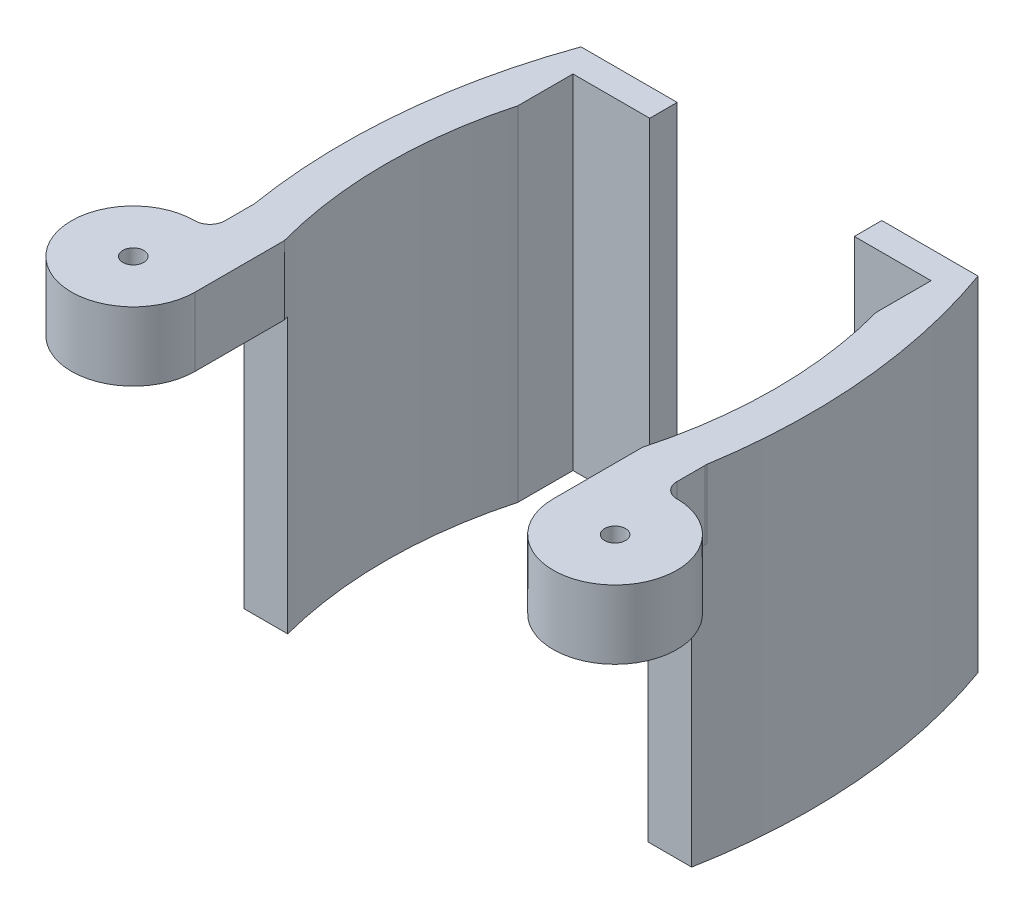
ISO-10303-21;
HEADER;
FILE_DESCRIPTION(('STEP AP214'),'2;1');
FILE_NAME('part.step','',(''),(''),'','','');
FILE_SCHEMA(('AUTOMOTIVE_DESIGN { 1 0 10303 214 1 1 1 1 }'));
ENDSEC;
DATA;
#1=APPLICATION_CONTEXT('core data for automotive mechanical design processes');
#2=APPLICATION_PROTOCOL_DEFINITION('international standard','automotive_design',2000,#1);
#3=PRODUCT_CONTEXT('',#1,'mechanical');
#4=PRODUCT('Part','Part','',(#3));
#5=PRODUCT_RELATED_PRODUCT_CATEGORY('part','',(#4));
#6=PRODUCT_DEFINITION_FORMATION('','',#4);
#7=PRODUCT_DEFINITION_CONTEXT('part definition',#1,'design');
#8=PRODUCT_DEFINITION('design','',#6,#7);
#9=PRODUCT_DEFINITION_SHAPE('','',#8);
#10=(LENGTH_UNIT() NAMED_UNIT(*) SI_UNIT(.MILLI.,.METRE.));
#11=(NAMED_UNIT(*) PLANE_ANGLE_UNIT() SI_UNIT($,.RADIAN.));
#12=(NAMED_UNIT(*) SI_UNIT($,.STERADIAN.) SOLID_ANGLE_UNIT());
#13=UNCERTAINTY_MEASURE_WITH_UNIT(LENGTH_MEASURE(1.E-05),#10,'distance_accuracy_value','');
#14=(GEOMETRIC_REPRESENTATION_CONTEXT(3) GLOBAL_UNCERTAINTY_ASSIGNED_CONTEXT((#13)) GLOBAL_UNIT_ASSIGNED_CONTEXT((#10,
#11,#12)) REPRESENTATION_CONTEXT('',''));
#15=CARTESIAN_POINT('',(0.,0.,0.));
#16=DIRECTION('',(0.,0.,1.));
#17=DIRECTION('',(1.,0.,0.));
#18=AXIS2_PLACEMENT_3D('',#15,#16,#17);
#19=CARTESIAN_POINT('',(17.3622752980796,0.,39.2467313511501));
#20=DIRECTION('',(0.,1.,0.));
#21=DIRECTION('',(0.,0.,1.));
#22=AXIS2_PLACEMENT_3D('',#19,#20,#21);
#23=PLANE('',#22);
#24=CARTESIAN_POINT('',(-70.9798633622335,0.,68.7645288120233));
#25=DIRECTION('',(0.,1.,0.));
#26=DIRECTION('',(0.,0.,1.));
#27=AXIS2_PLACEMENT_3D('',#24,#25,#26);
#28=CIRCLE('',#27,1.525);
#29=CARTESIAN_POINT('',(-70.9798633622335,0.,70.2895288120233));
#30=VERTEX_POINT('',#29);
#31=EDGE_CURVE('E239',#30,#30,#28,.T.);
#32=ORIENTED_EDGE('',*,*,#31,.F.);
#33=EDGE_LOOP('',(#32));
#34=FACE_BOUND('',#33,.T.);
#35=CARTESIAN_POINT('',(-70.9698282124346,0.,57.6104127686324));
#36=DIRECTION('',(0.,1.,0.));
#37=DIRECTION('',(0.,0.,1.));
#38=AXIS2_PLACEMENT_3D('',#35,#36,#37);
#39=CIRCLE('',#38,2.16920970238459);
#40=CARTESIAN_POINT('',(-70.9698282124346,0.,59.779622471017));
#41=VERTEX_POINT('',#40);
#42=CARTESIAN_POINT('',(-68.8006185100501,0.,57.6104127686324));
#43=VERTEX_POINT('',#42);
#44=EDGE_CURVE('E225',#41,#43,#39,.T.);
#45=ORIENTED_EDGE('',*,*,#44,.F.);
#46=CARTESIAN_POINT('',(-70.9949219793532,0.,68.7645288120234));
#47=DIRECTION('',(0.,1.,0.));
#48=DIRECTION('',(0.,0.,1.));
#49=AXIS2_PLACEMENT_3D('',#46,#47,#48);
#50=CIRCLE('',#49,8.9849413828803);
#51=CARTESIAN_POINT('',(-79.9798633622335,0.,68.7645288120233));
#52=VERTEX_POINT('',#51);
#53=EDGE_CURVE('E228',#41,#52,#50,.T.);
#54=ORIENTED_EDGE('',*,*,#53,.T.);
#55=CARTESIAN_POINT('',(-70.9798633622335,0.,68.7645288120233));
#56=DIRECTION('',(0.,1.,0.));
#57=DIRECTION('',(0.,0.,1.));
#58=AXIS2_PLACEMENT_3D('',#55,#56,#57);
#59=CIRCLE('',#58,9.00000000000001);
#60=CARTESIAN_POINT('',(-61.9798633622335,0.,68.7645288120233));
#61=VERTEX_POINT('',#60);
#62=EDGE_CURVE('E207',#52,#61,#59,.T.);
#63=ORIENTED_EDGE('',*,*,#62,.T.);
#64=DIRECTION('',(0.,0.,-1.));
#65=VECTOR('',#64,1.);
#66=CARTESIAN_POINT('',(-61.9798633622335,0.,63.7645288120233));
#67=LINE('',#66,#65);
#68=CARTESIAN_POINT('',(-61.9798633622335,0.,55.7645288120233));
#69=VERTEX_POINT('',#68);
#70=EDGE_CURVE('E143',#61,#69,#67,.T.);
#71=ORIENTED_EDGE('',*,*,#70,.T.);
#72=CARTESIAN_POINT('',(0.34316608916593,0.,38.7645288120234));
#73=DIRECTION('',(0.,-1.,0.));
#74=DIRECTION('',(0.,0.,-1.));
#75=AXIS2_PLACEMENT_3D('',#72,#73,#74);
#76=CIRCLE('',#75,64.6);
#77=CARTESIAN_POINT('',(-61.9798633622335,0.,21.7645288120234));
#78=VERTEX_POINT('',#77);
#79=EDGE_CURVE('E141',#69,#78,#76,.T.);
#80=ORIENTED_EDGE('',*,*,#79,.T.);
#81=DIRECTION('',(0.,0.,-1.));
#82=VECTOR('',#81,1.);
#83=CARTESIAN_POINT('',(-61.9798633622335,0.,21.7645288120234));
#84=LINE('',#83,#82);
#85=CARTESIAN_POINT('',(-61.9798633622335,0.,13.7645288120234));
#86=VERTEX_POINT('',#85);
#87=EDGE_CURVE('E124',#78,#86,#84,.T.);
#88=ORIENTED_EDGE('',*,*,#87,.T.);
#89=DIRECTION('',(1.,0.,0.));
#90=VECTOR('',#89,1.);
#91=CARTESIAN_POINT('',(-61.9798633622335,0.,13.7645288120234));
#92=LINE('',#91,#90);
#93=CARTESIAN_POINT('',(-50.8100577018505,0.,13.7645288120234));
#94=VERTEX_POINT('',#93);
#95=EDGE_CURVE('E132',#86,#94,#92,.T.);
#96=ORIENTED_EDGE('',*,*,#95,.T.);
#97=DIRECTION('',(0.,0.,-1.));
#98=VECTOR('',#97,1.);
#99=CARTESIAN_POINT('',(-50.8100577018505,0.,13.7645288120234));
#100=LINE('',#99,#98);
#101=CARTESIAN_POINT('',(-50.8100577018505,0.,9.76452881202337));
#102=VERTEX_POINT('',#101);
#103=EDGE_CURVE('E137',#94,#102,#100,.T.);
#104=ORIENTED_EDGE('',*,*,#103,.T.);
#105=DIRECTION('',(-1.,0.,0.));
#106=VECTOR('',#105,1.);
#107=CARTESIAN_POINT('',(-50.8100577018505,0.,9.76452881202337));
#108=LINE('',#107,#106);
#109=CARTESIAN_POINT('',(-64.8100577018505,0.,9.76452881202337));
#110=VERTEX_POINT('',#109);
#111=EDGE_CURVE('E161',#102,#110,#108,.T.);
#112=ORIENTED_EDGE('',*,*,#111,.T.);
#113=CARTESIAN_POINT('',(17.3622752980796,0.,39.2467313511501));
#114=DIRECTION('',(0.,1.,0.));
#115=DIRECTION('',(0.,0.,1.));
#116=AXIS2_PLACEMENT_3D('',#113,#114,#115);
#117=CIRCLE('',#116,87.3011602283125);
#118=CARTESIAN_POINT('',(-68.8006185100501,0.,53.298361428065));
#119=VERTEX_POINT('',#118);
#120=EDGE_CURVE('E65',#110,#119,#117,.T.);
#121=ORIENTED_EDGE('',*,*,#120,.T.);
#122=CARTESIAN_POINT('',(-70.0805033457437,0.,53.507087800374));
#123=DIRECTION('',(0.,-1.,0.));
#124=DIRECTION('',(0.,0.,1.));
#125=AXIS2_PLACEMENT_3D('',#122,#123,#124);
#126=CIRCLE('',#125,1.29679292531065);
#127=CARTESIAN_POINT('',(-68.8006185100501,0.,53.7158141726829));
#128=VERTEX_POINT('',#127);
#129=EDGE_CURVE('E197',#119,#128,#126,.T.);
#130=ORIENTED_EDGE('',*,*,#129,.T.);
#131=DIRECTION('',(0.,0.,1.));
#132=VECTOR('',#131,1.);
#133=CARTESIAN_POINT('',(-68.8006185100501,0.,0.));
#134=LINE('',#133,#132);
#135=EDGE_CURVE('E221',#128,#43,#134,.T.);
#136=ORIENTED_EDGE('',*,*,#135,.T.);
#137=EDGE_LOOP('',(#45,#54,#63,#71,#80,#88,#96,#104,#112,#121,#130,#136));
#138=FACE_BOUND('',#137,.T.);
#139=ADVANCED_FACE('F56',(#34,#138),#23,.T.);
#140=CARTESIAN_POINT('',(-70.9798633622335,-10.,63.7645288120233));
#141=DIRECTION('',(0.,-1.,0.));
#142=DIRECTION('',(0.,0.,-1.));
#143=AXIS2_PLACEMENT_3D('',#140,#141,#142);
#144=PLANE('',#143);
#145=CARTESIAN_POINT('',(-70.9798633622335,-10.,68.7645288120233));
#146=DIRECTION('',(0.,1.,0.));
#147=DIRECTION('',(0.,0.,1.));
#148=AXIS2_PLACEMENT_3D('',#145,#146,#147);
#149=CIRCLE('',#148,1.525);
#150=CARTESIAN_POINT('',(-70.9798633622335,-10.,70.2895288120233));
#151=VERTEX_POINT('',#150);
#152=EDGE_CURVE('E231',#151,#151,#149,.T.);
#153=ORIENTED_EDGE('',*,*,#152,.T.);
#154=EDGE_LOOP('',(#153));
#155=FACE_BOUND('',#154,.T.);
#156=CARTESIAN_POINT('',(-70.9798633622335,-10.,68.7645288120233));
#157=DIRECTION('',(0.,-1.,0.));
#158=DIRECTION('',(0.,0.,-1.));
#159=AXIS2_PLACEMENT_3D('',#156,#157,#158);
#160=CIRCLE('',#159,9.00000000000001);
#161=CARTESIAN_POINT('',(-79.9798633622335,-10.,68.7645288120233));
#162=VERTEX_POINT('',#161);
#163=CARTESIAN_POINT('',(-61.9798633622335,-10.,68.7645288120233));
#164=VERTEX_POINT('',#163);
#165=EDGE_CURVE('E206',#162,#164,#160,.F.);
#166=ORIENTED_EDGE('',*,*,#165,.F.);
#167=CARTESIAN_POINT('',(-70.9949219793532,-10.,68.7645288120234));
#168=DIRECTION('',(0.,1.,0.));
#169=DIRECTION('',(0.,0.,1.));
#170=AXIS2_PLACEMENT_3D('',#167,#168,#169);
#171=CIRCLE('',#170,8.9849413828803);
#172=CARTESIAN_POINT('',(-70.9698282124346,-10.,59.779622471017));
#173=VERTEX_POINT('',#172);
#174=EDGE_CURVE('E224',#173,#162,#171,.T.);
#175=ORIENTED_EDGE('',*,*,#174,.F.);
#176=CARTESIAN_POINT('',(-70.9698282124346,-10.,57.6104127686324));
#177=DIRECTION('',(0.,1.,0.));
#178=DIRECTION('',(0.,0.,1.));
#179=AXIS2_PLACEMENT_3D('',#176,#177,#178);
#180=CIRCLE('',#179,2.16920970238459);
#181=CARTESIAN_POINT('',(-68.8006185100501,-10.,57.6104127686324));
#182=VERTEX_POINT('',#181);
#183=EDGE_CURVE('E234',#173,#182,#180,.T.);
#184=ORIENTED_EDGE('',*,*,#183,.T.);
#185=DIRECTION('',(0.,0.,1.));
#186=VECTOR('',#185,1.);
#187=CARTESIAN_POINT('',(-68.8006185100501,-10.,0.));
#188=LINE('',#187,#186);
#189=CARTESIAN_POINT('',(-68.8006185100501,-10.,53.7158141726829));
#190=VERTEX_POINT('',#189);
#191=EDGE_CURVE('E218',#190,#182,#188,.T.);
#192=ORIENTED_EDGE('',*,*,#191,.F.);
#193=CARTESIAN_POINT('',(-70.0805033457437,-10.,53.507087800374));
#194=DIRECTION('',(0.,-1.,0.));
#195=DIRECTION('',(0.,0.,1.));
#196=AXIS2_PLACEMENT_3D('',#193,#194,#195);
#197=CIRCLE('',#196,1.29679292531065);
#198=CARTESIAN_POINT('',(-68.8006185100501,-10.,53.298361428065));
#199=VERTEX_POINT('',#198);
#200=EDGE_CURVE('E196',#199,#190,#197,.T.);
#201=ORIENTED_EDGE('',*,*,#200,.F.);
#202=CARTESIAN_POINT('',(17.3622752980796,-10.,39.2467313511501));
#203=DIRECTION('',(0.,1.,0.));
#204=DIRECTION('',(0.,0.,1.));
#205=AXIS2_PLACEMENT_3D('',#202,#203,#204);
#206=CIRCLE('',#205,87.3011602283125);
#207=CARTESIAN_POINT('',(-68.4841691205783,-10.,55.1174766986052));
#208=VERTEX_POINT('',#207);
#209=EDGE_CURVE('E188',#208,#199,#206,.F.);
#210=ORIENTED_EDGE('',*,*,#209,.F.);
#211=DIRECTION('',(1.,0.,0.));
#212=VECTOR('',#211,1.);
#213=CARTESIAN_POINT('',(-68.4841691205783,-10.,55.1174766986052));
#214=LINE('',#213,#212);
#215=CARTESIAN_POINT('',(-62.1527625415756,-10.,55.1174766986052));
#216=VERTEX_POINT('',#215);
#217=EDGE_CURVE('E184',#208,#216,#214,.T.);
#218=ORIENTED_EDGE('',*,*,#217,.T.);
#219=CARTESIAN_POINT('',(0.34316608916593,-10.,38.7645288120234));
#220=DIRECTION('',(0.,-1.,0.));
#221=DIRECTION('',(0.,0.,-1.));
#222=AXIS2_PLACEMENT_3D('',#219,#220,#221);
#223=CIRCLE('',#222,64.6);
#224=CARTESIAN_POINT('',(-61.9798633622335,-10.,55.7645288120233));
#225=VERTEX_POINT('',#224);
#226=EDGE_CURVE('E171',#225,#216,#223,.T.);
#227=ORIENTED_EDGE('',*,*,#226,.F.);
#228=DIRECTION('',(0.,0.,-1.));
#229=VECTOR('',#228,1.);
#230=CARTESIAN_POINT('',(-61.9798633622335,-10.,63.7645288120233));
#231=LINE('',#230,#229);
#232=EDGE_CURVE('E179',#164,#225,#231,.T.);
#233=ORIENTED_EDGE('',*,*,#232,.F.);
#234=EDGE_LOOP('',(#166,#175,#184,#192,#201,#210,#218,#227,#233));
#235=FACE_BOUND('',#234,.T.);
#236=ADVANCED_FACE('F245',(#155,#235),#144,.T.);
#237=CARTESIAN_POINT('',(-70.0805033457437,-10.,53.507087800374));
#238=DIRECTION('',(0.,1.,0.));
#239=DIRECTION('',(0.,0.,1.));
#240=AXIS2_PLACEMENT_3D('',#237,#238,#239);
#241=CYLINDRICAL_SURFACE('',#240,1.29679292531065);
#242=ORIENTED_EDGE('',*,*,#200,.T.);
#243=DIRECTION('',(0.,1.,0.));
#244=VECTOR('',#243,1.);
#245=CARTESIAN_POINT('',(-68.8006185100501,-10.,53.7158141726829));
#246=LINE('',#245,#244);
#247=EDGE_CURVE('E12',#190,#128,#246,.T.);
#248=ORIENTED_EDGE('',*,*,#247,.T.);
#249=ORIENTED_EDGE('',*,*,#129,.F.);
#250=DIRECTION('',(0.,1.,0.));
#251=VECTOR('',#250,1.);
#252=CARTESIAN_POINT('',(-68.8006185100501,-10.,53.298361428065));
#253=LINE('',#252,#251);
#254=EDGE_CURVE('E193',#199,#119,#253,.T.);
#255=ORIENTED_EDGE('',*,*,#254,.F.);
#256=EDGE_LOOP('',(#242,#248,#249,#255));
#257=FACE_BOUND('',#256,.T.);
#258=ADVANCED_FACE('F259',(#257),#241,.F.);
#259=CARTESIAN_POINT('',(-61.9798633622335,-50.,63.7645288120233));
#260=DIRECTION('',(1.,0.,0.));
#261=DIRECTION('',(0.,0.,-1.));
#262=AXIS2_PLACEMENT_3D('',#259,#260,#261);
#263=PLANE('',#262);
#264=ORIENTED_EDGE('',*,*,#70,.F.);
#265=DIRECTION('',(0.,1.,0.));
#266=VECTOR('',#265,1.);
#267=CARTESIAN_POINT('',(-61.9798633622335,-32.8035085019828,68.7645288120233));
#268=LINE('',#267,#266);
#269=EDGE_CURVE('E200',#164,#61,#268,.T.);
#270=ORIENTED_EDGE('',*,*,#269,.F.);
#271=ORIENTED_EDGE('',*,*,#232,.T.);
#272=DIRECTION('',(0.,1.,0.));
#273=VECTOR('',#272,1.);
#274=CARTESIAN_POINT('',(-61.9798633622335,-50.,55.7645288120233));
#275=LINE('',#274,#273);
#276=EDGE_CURVE('E73',#225,#69,#275,.T.);
#277=ORIENTED_EDGE('',*,*,#276,.T.);
#278=EDGE_LOOP('',(#264,#270,#271,#277));
#279=FACE_BOUND('',#278,.T.);
#280=ADVANCED_FACE('F277',(#279),#263,.T.);
#281=CARTESIAN_POINT('',(17.3622752980796,-50.,39.2467313511501));
#282=DIRECTION('',(0.,1.,0.));
#283=DIRECTION('',(0.,0.,1.));
#284=AXIS2_PLACEMENT_3D('',#281,#282,#283);
#285=CYLINDRICAL_SURFACE('',#284,87.3011602283125);
#286=ORIENTED_EDGE('',*,*,#254,.T.);
#287=ORIENTED_EDGE('',*,*,#120,.F.);
#288=DIRECTION('',(0.,1.,0.));
#289=VECTOR('',#288,1.);
#290=CARTESIAN_POINT('',(-64.8100577018505,-50.,9.76452881202337));
#291=LINE('',#290,#289);
#292=CARTESIAN_POINT('',(-64.8100577018505,-50.,9.76452881202337));
#293=VERTEX_POINT('',#292);
#294=EDGE_CURVE('E110',#293,#110,#291,.T.);
#295=ORIENTED_EDGE('',*,*,#294,.F.);
#296=CARTESIAN_POINT('',(17.3622752980796,-50.,39.2467313511501));
#297=DIRECTION('',(0.,1.,0.));
#298=DIRECTION('',(0.,0.,1.));
#299=AXIS2_PLACEMENT_3D('',#296,#297,#298);
#300=CIRCLE('',#299,87.3011602283125);
#301=CARTESIAN_POINT('',(-68.4841691205783,-50.,55.1174766986052));
#302=VERTEX_POINT('',#301);
#303=EDGE_CURVE('E159',#293,#302,#300,.T.);
#304=ORIENTED_EDGE('',*,*,#303,.T.);
#305=DIRECTION('',(0.,1.,0.));
#306=VECTOR('',#305,1.);
#307=CARTESIAN_POINT('',(-68.4841691205783,-50.,55.1174766986052));
#308=LINE('',#307,#306);
#309=EDGE_CURVE('E153',#302,#208,#308,.T.);
#310=ORIENTED_EDGE('',*,*,#309,.T.);
#311=ORIENTED_EDGE('',*,*,#209,.T.);
#312=EDGE_LOOP('',(#286,#287,#295,#304,#310,#311));
#313=FACE_BOUND('',#312,.T.);
#314=ADVANCED_FACE('F266',(#313),#285,.T.);
#315=CARTESIAN_POINT('',(-50.8100577018505,-50.,9.76452881202337));
#316=DIRECTION('',(0.,0.,-1.));
#317=DIRECTION('',(-1.,0.,0.));
#318=AXIS2_PLACEMENT_3D('',#315,#316,#317);
#319=PLANE('',#318);
#320=ORIENTED_EDGE('',*,*,#111,.F.);
#321=DIRECTION('',(0.,1.,0.));
#322=VECTOR('',#321,1.);
#323=CARTESIAN_POINT('',(-50.8100577018505,-50.,9.76452881202337));
#324=LINE('',#323,#322);
#325=CARTESIAN_POINT('',(-50.8100577018505,-50.,9.76452881202337));
#326=VERTEX_POINT('',#325);
#327=EDGE_CURVE('E170',#326,#102,#324,.T.);
#328=ORIENTED_EDGE('',*,*,#327,.F.);
#329=DIRECTION('',(-1.,0.,0.));
#330=VECTOR('',#329,1.);
#331=CARTESIAN_POINT('',(-50.8100577018505,-50.,9.76452881202337));
#332=LINE('',#331,#330);
#333=EDGE_CURVE('E150',#326,#293,#332,.T.);
#334=ORIENTED_EDGE('',*,*,#333,.T.);
#335=ORIENTED_EDGE('',*,*,#294,.T.);
#336=EDGE_LOOP('',(#320,#328,#334,#335));
#337=FACE_BOUND('',#336,.T.);
#338=ADVANCED_FACE('F262',(#337),#319,.T.);
#339=CARTESIAN_POINT('',(-50.8100577018505,-50.,13.7645288120234));
#340=DIRECTION('',(1.,0.,0.));
#341=DIRECTION('',(0.,0.,-1.));
#342=AXIS2_PLACEMENT_3D('',#339,#340,#341);
#343=PLANE('',#342);
#344=ORIENTED_EDGE('',*,*,#103,.F.);
#345=DIRECTION('',(0.,1.,0.));
#346=VECTOR('',#345,1.);
#347=CARTESIAN_POINT('',(-50.8100577018505,-50.,13.7645288120234));
#348=LINE('',#347,#346);
#349=CARTESIAN_POINT('',(-50.8100577018505,-50.,13.7645288120234));
#350=VERTEX_POINT('',#349);
#351=EDGE_CURVE('E129',#350,#94,#348,.T.);
#352=ORIENTED_EDGE('',*,*,#351,.F.);
#353=DIRECTION('',(0.,0.,-1.));
#354=VECTOR('',#353,1.);
#355=CARTESIAN_POINT('',(-50.8100577018505,-50.,13.7645288120234));
#356=LINE('',#355,#354);
#357=EDGE_CURVE('E152',#350,#326,#356,.T.);
#358=ORIENTED_EDGE('',*,*,#357,.T.);
#359=ORIENTED_EDGE('',*,*,#327,.T.);
#360=EDGE_LOOP('',(#344,#352,#358,#359));
#361=FACE_BOUND('',#360,.T.);
#362=ADVANCED_FACE('F265',(#361),#343,.T.);
#363=CARTESIAN_POINT('',(-61.9798633622335,-50.,13.7645288120234));
#364=DIRECTION('',(0.,0.,1.));
#365=DIRECTION('',(1.,0.,0.));
#366=AXIS2_PLACEMENT_3D('',#363,#364,#365);
#367=PLANE('',#366);
#368=ORIENTED_EDGE('',*,*,#95,.F.);
#369=DIRECTION('',(0.,1.,0.));
#370=VECTOR('',#369,1.);
#371=CARTESIAN_POINT('',(-61.9798633622335,-50.,13.7645288120234));
#372=LINE('',#371,#370);
#373=CARTESIAN_POINT('',(-61.9798633622335,-50.,13.7645288120234));
#374=VERTEX_POINT('',#373);
#375=EDGE_CURVE('E95',#374,#86,#372,.T.);
#376=ORIENTED_EDGE('',*,*,#375,.F.);
#377=DIRECTION('',(1.,0.,0.));
#378=VECTOR('',#377,1.);
#379=CARTESIAN_POINT('',(-61.9798633622335,-50.,13.7645288120234));
#380=LINE('',#379,#378);
#381=EDGE_CURVE('E156',#374,#350,#380,.T.);
#382=ORIENTED_EDGE('',*,*,#381,.T.);
#383=ORIENTED_EDGE('',*,*,#351,.T.);
#384=EDGE_LOOP('',(#368,#376,#382,#383));
#385=FACE_BOUND('',#384,.T.);
#386=ADVANCED_FACE('F133',(#385),#367,.T.);
#387=CARTESIAN_POINT('',(-61.9798633622335,-50.,21.7645288120234));
#388=DIRECTION('',(1.,0.,0.));
#389=DIRECTION('',(0.,0.,-1.));
#390=AXIS2_PLACEMENT_3D('',#387,#388,#389);
#391=PLANE('',#390);
#392=ORIENTED_EDGE('',*,*,#87,.F.);
#393=DIRECTION('',(0.,1.,0.));
#394=VECTOR('',#393,1.);
#395=CARTESIAN_POINT('',(-61.9798633622335,-50.,21.7645288120234));
#396=LINE('',#395,#394);
#397=CARTESIAN_POINT('',(-61.9798633622335,-50.,21.7645288120234));
#398=VERTEX_POINT('',#397);
#399=EDGE_CURVE('E128',#398,#78,#396,.T.);
#400=ORIENTED_EDGE('',*,*,#399,.F.);
#401=DIRECTION('',(0.,0.,-1.));
#402=VECTOR('',#401,1.);
#403=CARTESIAN_POINT('',(-61.9798633622335,-50.,21.7645288120234));
#404=LINE('',#403,#402);
#405=EDGE_CURVE('E127',#398,#374,#404,.T.);
#406=ORIENTED_EDGE('',*,*,#405,.T.);
#407=ORIENTED_EDGE('',*,*,#375,.T.);
#408=EDGE_LOOP('',(#392,#400,#406,#407));
#409=FACE_BOUND('',#408,.T.);
#410=ADVANCED_FACE('F122',(#409),#391,.T.);
#411=CARTESIAN_POINT('',(0.34316608916593,-50.,38.7645288120234));
#412=DIRECTION('',(0.,1.,0.));
#413=DIRECTION('',(0.,0.,1.));
#414=AXIS2_PLACEMENT_3D('',#411,#412,#413);
#415=CYLINDRICAL_SURFACE('',#414,64.6);
#416=DIRECTION('',(0.,1.,0.));
#417=VECTOR('',#416,1.);
#418=CARTESIAN_POINT('',(-62.1527625415756,-50.,55.1174766986052));
#419=LINE('',#418,#417);
#420=CARTESIAN_POINT('',(-62.1527625415756,-50.,55.1174766986052));
#421=VERTEX_POINT('',#420);
#422=EDGE_CURVE('E181',#421,#216,#419,.T.);
#423=ORIENTED_EDGE('',*,*,#422,.F.);
#424=CARTESIAN_POINT('',(0.34316608916593,-50.,38.7645288120234));
#425=DIRECTION('',(0.,-1.,0.));
#426=DIRECTION('',(0.,0.,-1.));
#427=AXIS2_PLACEMENT_3D('',#424,#425,#426);
#428=CIRCLE('',#427,64.6);
#429=EDGE_CURVE('E102',#421,#398,#428,.T.);
#430=ORIENTED_EDGE('',*,*,#429,.T.);
#431=ORIENTED_EDGE('',*,*,#399,.T.);
#432=ORIENTED_EDGE('',*,*,#79,.F.);
#433=ORIENTED_EDGE('',*,*,#276,.F.);
#434=ORIENTED_EDGE('',*,*,#226,.T.);
#435=EDGE_LOOP('',(#423,#430,#431,#432,#433,#434));
#436=FACE_BOUND('',#435,.T.);
#437=ADVANCED_FACE('F274',(#436),#415,.F.);
#438=CARTESIAN_POINT('',(17.3622752980796,-50.,39.2467313511501));
#439=DIRECTION('',(0.,1.,0.));
#440=DIRECTION('',(0.,0.,1.));
#441=AXIS2_PLACEMENT_3D('',#438,#439,#440);
#442=PLANE('',#441);
#443=ORIENTED_EDGE('',*,*,#429,.F.);
#444=DIRECTION('',(1.,0.,0.));
#445=VECTOR('',#444,1.);
#446=CARTESIAN_POINT('',(-62.1527625415756,-50.,55.1174766986052));
#447=LINE('',#446,#445);
#448=EDGE_CURVE('E185',#302,#421,#447,.T.);
#449=ORIENTED_EDGE('',*,*,#448,.F.);
#450=ORIENTED_EDGE('',*,*,#303,.F.);
#451=ORIENTED_EDGE('',*,*,#333,.F.);
#452=ORIENTED_EDGE('',*,*,#357,.F.);
#453=ORIENTED_EDGE('',*,*,#381,.F.);
#454=ORIENTED_EDGE('',*,*,#405,.F.);
#455=EDGE_LOOP('',(#443,#449,#450,#451,#452,#453,#454));
#456=FACE_BOUND('',#455,.T.);
#457=ADVANCED_FACE('F58',(#456),#442,.F.);
#458=CARTESIAN_POINT('',(-62.1527625415756,-10.,55.1174766986052));
#459=DIRECTION('',(0.,0.,-1.));
#460=DIRECTION('',(-1.,0.,0.));
#461=AXIS2_PLACEMENT_3D('',#458,#459,#460);
#462=PLANE('',#461);
#463=ORIENTED_EDGE('',*,*,#422,.T.);
#464=ORIENTED_EDGE('',*,*,#217,.F.);
#465=ORIENTED_EDGE('',*,*,#309,.F.);
#466=ORIENTED_EDGE('',*,*,#448,.T.);
#467=EDGE_LOOP('',(#463,#464,#465,#466));
#468=FACE_BOUND('',#467,.T.);
#469=ADVANCED_FACE('F282',(#468),#462,.F.);
#470=CARTESIAN_POINT('',(-70.9798633622335,-32.8035085019828,68.7645288120233));
#471=DIRECTION('',(0.,1.,0.));
#472=DIRECTION('',(0.,0.,1.));
#473=AXIS2_PLACEMENT_3D('',#470,#471,#472);
#474=CYLINDRICAL_SURFACE('',#473,9.00000000000001);
#475=DIRECTION('',(0.,1.,0.));
#476=VECTOR('',#475,1.);
#477=CARTESIAN_POINT('',(-79.9798633622335,-32.8035085019828,68.7645288120233));
#478=LINE('',#477,#476);
#479=EDGE_CURVE('E203',#162,#52,#478,.T.);
#480=ORIENTED_EDGE('',*,*,#479,.F.);
#481=ORIENTED_EDGE('',*,*,#165,.T.);
#482=ORIENTED_EDGE('',*,*,#269,.T.);
#483=ORIENTED_EDGE('',*,*,#62,.F.);
#484=EDGE_LOOP('',(#480,#481,#482,#483));
#485=FACE_BOUND('',#484,.T.);
#486=ADVANCED_FACE('F285',(#485),#474,.T.);
#487=CARTESIAN_POINT('',(-70.9949219793532,-10.,68.7645288120234));
#488=DIRECTION('',(0.,1.,0.));
#489=DIRECTION('',(0.,0.,1.));
#490=AXIS2_PLACEMENT_3D('',#487,#488,#489);
#491=CYLINDRICAL_SURFACE('',#490,8.9849413828803);
#492=ORIENTED_EDGE('',*,*,#53,.F.);
#493=DIRECTION('',(0.,1.,0.));
#494=VECTOR('',#493,1.);
#495=CARTESIAN_POINT('',(-70.9698282124346,-10.,59.779622471017));
#496=LINE('',#495,#494);
#497=EDGE_CURVE('E215',#173,#41,#496,.T.);
#498=ORIENTED_EDGE('',*,*,#497,.F.);
#499=ORIENTED_EDGE('',*,*,#174,.T.);
#500=ORIENTED_EDGE('',*,*,#479,.T.);
#501=EDGE_LOOP('',(#492,#498,#499,#500));
#502=FACE_BOUND('',#501,.T.);
#503=ADVANCED_FACE('F292',(#502),#491,.T.);
#504=CARTESIAN_POINT('',(-68.8006185100501,-10.,0.));
#505=DIRECTION('',(-1.,0.,0.));
#506=DIRECTION('',(0.,0.,1.));
#507=AXIS2_PLACEMENT_3D('',#504,#505,#506);
#508=PLANE('',#507);
#509=ORIENTED_EDGE('',*,*,#191,.T.);
#510=DIRECTION('',(0.,1.,0.));
#511=VECTOR('',#510,1.);
#512=CARTESIAN_POINT('',(-68.8006185100501,-10.,57.6104127686324));
#513=LINE('',#512,#511);
#514=EDGE_CURVE('E214',#182,#43,#513,.T.);
#515=ORIENTED_EDGE('',*,*,#514,.T.);
#516=ORIENTED_EDGE('',*,*,#135,.F.);
#517=ORIENTED_EDGE('',*,*,#247,.F.);
#518=EDGE_LOOP('',(#509,#515,#516,#517));
#519=FACE_BOUND('',#518,.T.);
#520=ADVANCED_FACE('F296',(#519),#508,.T.);
#521=CARTESIAN_POINT('',(-70.9698282124346,-10.,57.6104127686324));
#522=DIRECTION('',(0.,1.,0.));
#523=DIRECTION('',(0.,0.,1.));
#524=AXIS2_PLACEMENT_3D('',#521,#522,#523);
#525=CYLINDRICAL_SURFACE('',#524,2.16920970238459);
#526=ORIENTED_EDGE('',*,*,#44,.T.);
#527=ORIENTED_EDGE('',*,*,#514,.F.);
#528=ORIENTED_EDGE('',*,*,#183,.F.);
#529=ORIENTED_EDGE('',*,*,#497,.T.);
#530=EDGE_LOOP('',(#526,#527,#528,#529));
#531=FACE_BOUND('',#530,.T.);
#532=ADVANCED_FACE('F251',(#531),#525,.F.);
#533=CARTESIAN_POINT('',(-70.9798633622335,-10.,68.7645288120233));
#534=DIRECTION('',(0.,1.,0.));
#535=DIRECTION('',(0.,0.,1.));
#536=AXIS2_PLACEMENT_3D('',#533,#534,#535);
#537=CYLINDRICAL_SURFACE('',#536,1.525);
#538=ORIENTED_EDGE('',*,*,#152,.F.);
#539=EDGE_LOOP('',(#538));
#540=FACE_BOUND('',#539,.T.);
#541=ORIENTED_EDGE('',*,*,#31,.T.);
#542=EDGE_LOOP('',(#541));
#543=FACE_BOUND('',#542,.T.);
#544=ADVANCED_FACE('F248',(#540,#543),#537,.F.);
#545=CLOSED_SHELL('',(#139,#236,#258,#280,#314,#338,#362,#386,#410,#437,#457,#469,#486,#503,
#520,#532,#544));
#546=MANIFOLD_SOLID_BREP('B2',#545);
#547=CARTESIAN_POINT('',(-9.85551112134364,-50.,63.7645288120234));
#548=DIRECTION('',(-1.,0.,0.));
#549=DIRECTION('',(0.,0.,1.));
#550=AXIS2_PLACEMENT_3D('',#547,#548,#549);
#551=PLANE('',#550);
#552=DIRECTION('',(0.,1.,0.));
#553=VECTOR('',#552,1.);
#554=CARTESIAN_POINT('',(-9.85551112134364,-50.,55.7645288120234));
#555=LINE('',#554,#553);
#556=CARTESIAN_POINT('',(-9.85551112134364,-10.,55.7645288120234));
#557=VERTEX_POINT('',#556);
#558=CARTESIAN_POINT('',(-9.85551112134364,0.,55.7645288120234));
#559=VERTEX_POINT('',#558);
#560=EDGE_CURVE('E537',#557,#559,#555,.T.);
#561=ORIENTED_EDGE('',*,*,#560,.F.);
#562=DIRECTION('',(0.,0.,1.));
#563=VECTOR('',#562,1.);
#564=CARTESIAN_POINT('',(-9.85551112134364,-10.,63.7645288120234));
#565=LINE('',#564,#563);
#566=CARTESIAN_POINT('',(-9.85551112134364,-10.,68.7645288120233));
#567=VERTEX_POINT('',#566);
#568=EDGE_CURVE('E698',#557,#567,#565,.T.);
#569=ORIENTED_EDGE('',*,*,#568,.T.);
#570=DIRECTION('',(0.,1.,0.));
#571=VECTOR('',#570,1.);
#572=CARTESIAN_POINT('',(-9.85551112134364,-32.8035085019828,68.7645288120233));
#573=LINE('',#572,#571);
#574=CARTESIAN_POINT('',(-9.85551112134364,0.,68.7645288120233));
#575=VERTEX_POINT('',#574);
#576=EDGE_CURVE('E732',#567,#575,#573,.T.);
#577=ORIENTED_EDGE('',*,*,#576,.T.);
#578=DIRECTION('',(0.,0.,1.));
#579=VECTOR('',#578,1.);
#580=CARTESIAN_POINT('',(-9.85551112134364,0.,63.7645288120234));
#581=LINE('',#580,#579);
#582=EDGE_CURVE('E655',#559,#575,#581,.T.);
#583=ORIENTED_EDGE('',*,*,#582,.F.);
#584=EDGE_LOOP('',(#561,#569,#577,#583));
#585=FACE_BOUND('',#584,.T.);
#586=ADVANCED_FACE('F528',(#585),#551,.T.);
#587=CARTESIAN_POINT('',(-72.1785405727431,-50.,38.7645288120234));
#588=DIRECTION('',(0.,1.,0.));
#589=DIRECTION('',(0.,0.,1.));
#590=AXIS2_PLACEMENT_3D('',#587,#588,#589);
#591=CYLINDRICAL_SURFACE('',#590,64.6);
#592=DIRECTION('',(0.,1.,0.));
#593=VECTOR('',#592,1.);
#594=CARTESIAN_POINT('',(-9.68261194200155,-50.,55.1174766986052));
#595=LINE('',#594,#593);
#596=CARTESIAN_POINT('',(-9.68261194200154,-10.,55.1174766986052));
#597=VERTEX_POINT('',#596);
#598=CARTESIAN_POINT('',(-9.68261194200155,-50.,55.1174766986052));
#599=VERTEX_POINT('',#598);
#600=EDGE_CURVE('E702',#597,#599,#595,.F.);
#601=ORIENTED_EDGE('',*,*,#600,.F.);
#602=CARTESIAN_POINT('',(-72.1785405727431,-10.,38.7645288120234));
#603=DIRECTION('',(0.,-1.,0.));
#604=DIRECTION('',(0.,0.,-1.));
#605=AXIS2_PLACEMENT_3D('',#602,#603,#604);
#606=CIRCLE('',#605,64.6);
#607=EDGE_CURVE('E639',#597,#557,#606,.T.);
#608=ORIENTED_EDGE('',*,*,#607,.T.);
#609=ORIENTED_EDGE('',*,*,#560,.T.);
#610=CARTESIAN_POINT('',(-72.1785405727431,0.,38.7645288120234));
#611=DIRECTION('',(0.,-1.,0.));
#612=DIRECTION('',(0.,0.,1.));
#613=AXIS2_PLACEMENT_3D('',#610,#611,#612);
#614=CIRCLE('',#613,64.6);
#615=CARTESIAN_POINT('',(-9.85551112134365,0.,21.7645288120234));
#616=VERTEX_POINT('',#615);
#617=EDGE_CURVE('E652',#616,#559,#614,.T.);
#618=ORIENTED_EDGE('',*,*,#617,.F.);
#619=DIRECTION('',(0.,1.,0.));
#620=VECTOR('',#619,1.);
#621=CARTESIAN_POINT('',(-9.85551112134365,-50.,21.7645288120234));
#622=LINE('',#621,#620);
#623=CARTESIAN_POINT('',(-9.85551112134365,-50.,21.7645288120234));
#624=VERTEX_POINT('',#623);
#625=EDGE_CURVE('E553',#624,#616,#622,.T.);
#626=ORIENTED_EDGE('',*,*,#625,.F.);
#627=CARTESIAN_POINT('',(-72.1785405727431,-50.,38.7645288120234));
#628=DIRECTION('',(0.,-1.,0.));
#629=DIRECTION('',(0.,0.,1.));
#630=AXIS2_PLACEMENT_3D('',#627,#628,#629);
#631=CIRCLE('',#630,64.6);
#632=EDGE_CURVE('E631',#624,#599,#631,.T.);
#633=ORIENTED_EDGE('',*,*,#632,.T.);
#634=EDGE_LOOP('',(#601,#608,#609,#618,#626,#633));
#635=FACE_BOUND('',#634,.T.);
#636=ADVANCED_FACE('F812',(#635),#591,.F.);
#637=CARTESIAN_POINT('',(-9.85551112134364,-50.,21.7645288120234));
#638=DIRECTION('',(-1.,0.,0.));
#639=DIRECTION('',(0.,0.,1.));
#640=AXIS2_PLACEMENT_3D('',#637,#638,#639);
#641=PLANE('',#640);
#642=DIRECTION('',(0.,0.,1.));
#643=VECTOR('',#642,1.);
#644=CARTESIAN_POINT('',(-9.85551112134364,0.,21.7645288120234));
#645=LINE('',#644,#643);
#646=CARTESIAN_POINT('',(-9.85551112134364,0.,13.7645288120234));
#647=VERTEX_POINT('',#646);
#648=EDGE_CURVE('E648',#647,#616,#645,.T.);
#649=ORIENTED_EDGE('',*,*,#648,.F.);
#650=DIRECTION('',(0.,1.,0.));
#651=VECTOR('',#650,1.);
#652=CARTESIAN_POINT('',(-9.85551112134364,-50.,13.7645288120234));
#653=LINE('',#652,#651);
#654=CARTESIAN_POINT('',(-9.85551112134364,-50.,13.7645288120234));
#655=VERTEX_POINT('',#654);
#656=EDGE_CURVE('E607',#655,#647,#653,.T.);
#657=ORIENTED_EDGE('',*,*,#656,.F.);
#658=DIRECTION('',(0.,0.,1.));
#659=VECTOR('',#658,1.);
#660=CARTESIAN_POINT('',(-9.85551112134364,-50.,21.7645288120234));
#661=LINE('',#660,#659);
#662=EDGE_CURVE('E617',#655,#624,#661,.T.);
#663=ORIENTED_EDGE('',*,*,#662,.T.);
#664=ORIENTED_EDGE('',*,*,#625,.T.);
#665=EDGE_LOOP('',(#649,#657,#663,#664));
#666=FACE_BOUND('',#665,.T.);
#667=ADVANCED_FACE('F818',(#666),#641,.T.);
#668=CARTESIAN_POINT('',(-9.85551112134364,-50.,13.7645288120234));
#669=DIRECTION('',(0.,0.,1.));
#670=DIRECTION('',(1.,0.,0.));
#671=AXIS2_PLACEMENT_3D('',#668,#669,#670);
#672=PLANE('',#671);
#673=DIRECTION('',(1.,0.,0.));
#674=VECTOR('',#673,1.);
#675=CARTESIAN_POINT('',(-9.85551112134364,0.,13.7645288120234));
#676=LINE('',#675,#674);
#677=CARTESIAN_POINT('',(-21.0253167817267,0.,13.7645288120234));
#678=VERTEX_POINT('',#677);
#679=EDGE_CURVE('E601',#678,#647,#676,.T.);
#680=ORIENTED_EDGE('',*,*,#679,.F.);
#681=DIRECTION('',(0.,1.,0.));
#682=VECTOR('',#681,1.);
#683=CARTESIAN_POINT('',(-21.0253167817267,-50.,13.7645288120234));
#684=LINE('',#683,#682);
#685=CARTESIAN_POINT('',(-21.0253167817267,-50.,13.7645288120234));
#686=VERTEX_POINT('',#685);
#687=EDGE_CURVE('E596',#686,#678,#684,.T.);
#688=ORIENTED_EDGE('',*,*,#687,.F.);
#689=DIRECTION('',(1.,0.,0.));
#690=VECTOR('',#689,1.);
#691=CARTESIAN_POINT('',(-9.85551112134364,-50.,13.7645288120234));
#692=LINE('',#691,#690);
#693=EDGE_CURVE('E599',#686,#655,#692,.T.);
#694=ORIENTED_EDGE('',*,*,#693,.T.);
#695=ORIENTED_EDGE('',*,*,#656,.T.);
#696=EDGE_LOOP('',(#680,#688,#694,#695));
#697=FACE_BOUND('',#696,.T.);
#698=ADVANCED_FACE('F598',(#697),#672,.T.);
#699=CARTESIAN_POINT('',(-21.0253167817267,-50.,13.7645288120234));
#700=DIRECTION('',(-1.,0.,0.));
#701=DIRECTION('',(0.,0.,1.));
#702=AXIS2_PLACEMENT_3D('',#699,#700,#701);
#703=PLANE('',#702);
#704=DIRECTION('',(0.,0.,1.));
#705=VECTOR('',#704,1.);
#706=CARTESIAN_POINT('',(-21.0253167817267,0.,13.7645288120234));
#707=LINE('',#706,#705);
#708=CARTESIAN_POINT('',(-21.0253167817267,0.,9.76452881202336));
#709=VERTEX_POINT('',#708);
#710=EDGE_CURVE('E643',#709,#678,#707,.T.);
#711=ORIENTED_EDGE('',*,*,#710,.F.);
#712=DIRECTION('',(0.,1.,0.));
#713=VECTOR('',#712,1.);
#714=CARTESIAN_POINT('',(-21.0253167817267,-50.,9.76452881202336));
#715=LINE('',#714,#713);
#716=CARTESIAN_POINT('',(-21.0253167817267,-50.,9.76452881202336));
#717=VERTEX_POINT('',#716);
#718=EDGE_CURVE('E608',#717,#709,#715,.T.);
#719=ORIENTED_EDGE('',*,*,#718,.F.);
#720=DIRECTION('',(0.,0.,1.));
#721=VECTOR('',#720,1.);
#722=CARTESIAN_POINT('',(-21.0253167817267,-50.,13.7645288120234));
#723=LINE('',#722,#721);
#724=EDGE_CURVE('E615',#717,#686,#723,.T.);
#725=ORIENTED_EDGE('',*,*,#724,.T.);
#726=ORIENTED_EDGE('',*,*,#687,.T.);
#727=EDGE_LOOP('',(#711,#719,#725,#726));
#728=FACE_BOUND('',#727,.T.);
#729=ADVANCED_FACE('F620',(#728),#703,.T.);
#730=CARTESIAN_POINT('',(-21.0253167817267,-50.,9.76452881202336));
#731=DIRECTION('',(0.,0.,-1.));
#732=DIRECTION('',(-1.,0.,0.));
#733=AXIS2_PLACEMENT_3D('',#730,#731,#732);
#734=PLANE('',#733);
#735=DIRECTION('',(-1.,0.,0.));
#736=VECTOR('',#735,1.);
#737=CARTESIAN_POINT('',(-21.0253167817267,0.,9.76452881202336));
#738=LINE('',#737,#736);
#739=CARTESIAN_POINT('',(-7.02531678172666,0.,9.76452881202336));
#740=VERTEX_POINT('',#739);
#741=EDGE_CURVE('E638',#740,#709,#738,.T.);
#742=ORIENTED_EDGE('',*,*,#741,.F.);
#743=DIRECTION('',(0.,1.,0.));
#744=VECTOR('',#743,1.);
#745=CARTESIAN_POINT('',(-7.02531678172666,-50.,9.76452881202336));
#746=LINE('',#745,#744);
#747=CARTESIAN_POINT('',(-7.02531678172666,-50.,9.76452881202336));
#748=VERTEX_POINT('',#747);
#749=EDGE_CURVE('E586',#748,#740,#746,.T.);
#750=ORIENTED_EDGE('',*,*,#749,.F.);
#751=DIRECTION('',(-1.,0.,0.));
#752=VECTOR('',#751,1.);
#753=CARTESIAN_POINT('',(-21.0253167817267,-50.,9.76452881202336));
#754=LINE('',#753,#752);
#755=EDGE_CURVE('E622',#748,#717,#754,.T.);
#756=ORIENTED_EDGE('',*,*,#755,.T.);
#757=ORIENTED_EDGE('',*,*,#718,.T.);
#758=EDGE_LOOP('',(#742,#750,#756,#757));
#759=FACE_BOUND('',#758,.T.);
#760=ADVANCED_FACE('F804',(#759),#734,.T.);
#761=CARTESIAN_POINT('',(-89.1976497816567,-50.,39.2467313511501));
#762=DIRECTION('',(0.,1.,0.));
#763=DIRECTION('',(0.,0.,1.));
#764=AXIS2_PLACEMENT_3D('',#761,#762,#763);
#765=CYLINDRICAL_SURFACE('',#764,87.3011602283125);
#766=DIRECTION('',(0.,1.,0.));
#767=VECTOR('',#766,1.);
#768=CARTESIAN_POINT('',(-3.02456392552264,-50.,53.2357217093151));
#769=LINE('',#768,#767);
#770=CARTESIAN_POINT('',(-3.02456392552264,-10.,53.2357217093151));
#771=VERTEX_POINT('',#770);
#772=CARTESIAN_POINT('',(-3.02456392552264,0.,53.2357217093151));
#773=VERTEX_POINT('',#772);
#774=EDGE_CURVE('E707',#771,#773,#769,.T.);
#775=ORIENTED_EDGE('',*,*,#774,.F.);
#776=CARTESIAN_POINT('',(-89.1976497816567,-10.,39.2467313511501));
#777=DIRECTION('',(0.,1.,0.));
#778=DIRECTION('',(0.,0.,1.));
#779=AXIS2_PLACEMENT_3D('',#776,#777,#778);
#780=CIRCLE('',#779,87.3011602283125);
#781=CARTESIAN_POINT('',(-3.35120536299882,-10.,55.1174766986052));
#782=VERTEX_POINT('',#781);
#783=EDGE_CURVE('E691',#771,#782,#780,.F.);
#784=ORIENTED_EDGE('',*,*,#783,.T.);
#785=DIRECTION('',(0.,1.,0.));
#786=VECTOR('',#785,1.);
#787=CARTESIAN_POINT('',(-3.35120536299882,-50.,55.1174766986052));
#788=LINE('',#787,#786);
#789=CARTESIAN_POINT('',(-3.35120536299882,-50.,55.1174766986052));
#790=VERTEX_POINT('',#789);
#791=EDGE_CURVE('E634',#790,#782,#788,.T.);
#792=ORIENTED_EDGE('',*,*,#791,.F.);
#793=CARTESIAN_POINT('',(-89.1976497816567,-50.,39.2467313511501));
#794=DIRECTION('',(0.,1.,0.));
#795=DIRECTION('',(0.,0.,-1.));
#796=AXIS2_PLACEMENT_3D('',#793,#794,#795);
#797=CIRCLE('',#796,87.3011602283125);
#798=EDGE_CURVE('E625',#790,#748,#797,.T.);
#799=ORIENTED_EDGE('',*,*,#798,.T.);
#800=ORIENTED_EDGE('',*,*,#749,.T.);
#801=CARTESIAN_POINT('',(-89.1976497816567,0.,39.2467313511501));
#802=DIRECTION('',(0.,1.,0.));
#803=DIRECTION('',(0.,0.,-1.));
#804=AXIS2_PLACEMENT_3D('',#801,#802,#803);
#805=CIRCLE('',#804,87.3011602283125);
#806=EDGE_CURVE('E635',#773,#740,#805,.T.);
#807=ORIENTED_EDGE('',*,*,#806,.F.);
#808=EDGE_LOOP('',(#775,#784,#792,#799,#800,#807));
#809=FACE_BOUND('',#808,.T.);
#810=ADVANCED_FACE('F530',(#809),#765,.T.);
#811=CARTESIAN_POINT('',(-0.855511121343641,-50.,63.7645288120234));
#812=DIRECTION('',(0.,1.,0.));
#813=DIRECTION('',(0.,0.,1.));
#814=AXIS2_PLACEMENT_3D('',#811,#812,#813);
#815=PLANE('',#814);
#816=ORIENTED_EDGE('',*,*,#798,.F.);
#817=DIRECTION('',(1.,0.,0.));
#818=VECTOR('',#817,1.);
#819=CARTESIAN_POINT('',(-62.1527625415756,-50.,55.1174766986052));
#820=LINE('',#819,#818);
#821=EDGE_CURVE('E683',#599,#790,#820,.T.);
#822=ORIENTED_EDGE('',*,*,#821,.F.);
#823=ORIENTED_EDGE('',*,*,#632,.F.);
#824=ORIENTED_EDGE('',*,*,#662,.F.);
#825=ORIENTED_EDGE('',*,*,#693,.F.);
#826=ORIENTED_EDGE('',*,*,#724,.F.);
#827=ORIENTED_EDGE('',*,*,#755,.F.);
#828=EDGE_LOOP('',(#816,#822,#823,#824,#825,#826,#827));
#829=FACE_BOUND('',#828,.T.);
#830=ADVANCED_FACE('F614',(#829),#815,.F.);
#831=CARTESIAN_POINT('',(-0.855511121343641,0.,63.7645288120234));
#832=DIRECTION('',(0.,1.,0.));
#833=DIRECTION('',(0.,0.,1.));
#834=AXIS2_PLACEMENT_3D('',#831,#832,#833);
#835=PLANE('',#834);
#836=CARTESIAN_POINT('',(-0.855511121343641,0.,68.7645288120233));
#837=DIRECTION('',(0.,1.,0.));
#838=DIRECTION('',(0.,0.,1.));
#839=AXIS2_PLACEMENT_3D('',#836,#837,#838);
#840=CIRCLE('',#839,1.525);
#841=CARTESIAN_POINT('',(-0.855511121343641,0.,70.2895288120233));
#842=VERTEX_POINT('',#841);
#843=EDGE_CURVE('E761',#842,#842,#840,.T.);
#844=ORIENTED_EDGE('',*,*,#843,.F.);
#845=EDGE_LOOP('',(#844));
#846=FACE_BOUND('',#845,.T.);
#847=DIRECTION('',(0.,0.,1.));
#848=VECTOR('',#847,1.);
#849=CARTESIAN_POINT('',(-3.02456392552264,0.,0.));
#850=LINE('',#849,#848);
#851=CARTESIAN_POINT('',(-3.02456392552264,0.,53.5092276835066));
#852=VERTEX_POINT('',#851);
#853=CARTESIAN_POINT('',(-3.02456392552264,0.,57.5954760078444));
#854=VERTEX_POINT('',#853);
#855=EDGE_CURVE('E752',#852,#854,#850,.T.);
#856=ORIENTED_EDGE('',*,*,#855,.F.);
#857=CARTESIAN_POINT('',(-1.62110988332484,0.,53.3836624149525));
#858=DIRECTION('',(0.,-1.,0.));
#859=DIRECTION('',(0.,0.,1.));
#860=AXIS2_PLACEMENT_3D('',#857,#858,#859);
#861=CIRCLE('',#860,1.40905992960853);
#862=CARTESIAN_POINT('',(-3.0222338621668,0.,53.2343256105724));
#863=VERTEX_POINT('',#862);
#864=EDGE_CURVE('E714',#852,#863,#861,.T.);
#865=ORIENTED_EDGE('',*,*,#864,.T.);
#866=DIRECTION('',(-0.857807737804425,0.,0.513970704381927));
#867=VECTOR('',#866,1.);
#868=CARTESIAN_POINT('',(-3.0222338621668,0.,53.2343256105724));
#869=LINE('',#868,#867);
#870=EDGE_CURVE('E544',#863,#773,#869,.T.);
#871=ORIENTED_EDGE('',*,*,#870,.T.);
#872=ORIENTED_EDGE('',*,*,#806,.T.);
#873=ORIENTED_EDGE('',*,*,#741,.T.);
#874=ORIENTED_EDGE('',*,*,#710,.T.);
#875=ORIENTED_EDGE('',*,*,#679,.T.);
#876=ORIENTED_EDGE('',*,*,#648,.T.);
#877=ORIENTED_EDGE('',*,*,#617,.T.);
#878=ORIENTED_EDGE('',*,*,#582,.T.);
#879=CARTESIAN_POINT('',(-0.855511121343641,0.,68.7645288120233));
#880=DIRECTION('',(0.,1.,0.));
#881=DIRECTION('',(0.,0.,1.));
#882=AXIS2_PLACEMENT_3D('',#879,#880,#881);
#883=CIRCLE('',#882,9.);
#884=CARTESIAN_POINT('',(-0.855511121343644,0.,59.7645288120234));
#885=VERTEX_POINT('',#884);
#886=EDGE_CURVE('E731',#575,#885,#883,.T.);
#887=ORIENTED_EDGE('',*,*,#886,.T.);
#888=CARTESIAN_POINT('',(-0.855511121343645,0.,57.5954760078444));
#889=DIRECTION('',(0.,1.,0.));
#890=DIRECTION('',(0.,0.,1.));
#891=AXIS2_PLACEMENT_3D('',#888,#889,#890);
#892=CIRCLE('',#891,2.16905280417899);
#893=EDGE_CURVE('E757',#885,#854,#892,.F.);
#894=ORIENTED_EDGE('',*,*,#893,.T.);
#895=EDGE_LOOP('',(#856,#865,#871,#872,#873,#874,#875,#876,#877,#878,#887,#894));
#896=FACE_BOUND('',#895,.T.);
#897=ADVANCED_FACE('F778',(#846,#896),#835,.T.);
#898=CARTESIAN_POINT('',(-0.855511121343641,-10.,63.7645288120234));
#899=DIRECTION('',(0.,-1.,0.));
#900=DIRECTION('',(0.,0.,-1.));
#901=AXIS2_PLACEMENT_3D('',#898,#899,#900);
#902=PLANE('',#901);
#903=CARTESIAN_POINT('',(-0.855511121343641,-10.,68.7645288120233));
#904=DIRECTION('',(0.,1.,0.));
#905=DIRECTION('',(0.,0.,1.));
#906=AXIS2_PLACEMENT_3D('',#903,#904,#905);
#907=CIRCLE('',#906,1.525);
#908=CARTESIAN_POINT('',(-0.855511121343641,-10.,70.2895288120233));
#909=VERTEX_POINT('',#908);
#910=EDGE_CURVE('E768',#909,#909,#907,.T.);
#911=ORIENTED_EDGE('',*,*,#910,.T.);
#912=EDGE_LOOP('',(#911));
#913=FACE_BOUND('',#912,.T.);
#914=DIRECTION('',(0.,0.,1.));
#915=VECTOR('',#914,1.);
#916=CARTESIAN_POINT('',(-3.02456392552264,-10.,0.));
#917=LINE('',#916,#915);
#918=CARTESIAN_POINT('',(-3.02456392552264,-10.,53.5092276835066));
#919=VERTEX_POINT('',#918);
#920=CARTESIAN_POINT('',(-3.02456392552264,-10.,57.5954760078444));
#921=VERTEX_POINT('',#920);
#922=EDGE_CURVE('E748',#919,#921,#917,.T.);
#923=ORIENTED_EDGE('',*,*,#922,.T.);
#924=CARTESIAN_POINT('',(-0.855511121343645,-10.,57.5954760078444));
#925=DIRECTION('',(0.,1.,0.));
#926=DIRECTION('',(0.,0.,1.));
#927=AXIS2_PLACEMENT_3D('',#924,#925,#926);
#928=CIRCLE('',#927,2.16905280417899);
#929=CARTESIAN_POINT('',(-0.855511121343644,-10.,59.7645288120234));
#930=VERTEX_POINT('',#929);
#931=EDGE_CURVE('E756',#930,#921,#928,.F.);
#932=ORIENTED_EDGE('',*,*,#931,.F.);
#933=CARTESIAN_POINT('',(-0.855511121343641,-10.,68.7645288120233));
#934=DIRECTION('',(0.,-1.,0.));
#935=DIRECTION('',(0.,0.,-1.));
#936=AXIS2_PLACEMENT_3D('',#933,#934,#935);
#937=CIRCLE('',#936,9.);
#938=EDGE_CURVE('E736',#567,#930,#937,.F.);
#939=ORIENTED_EDGE('',*,*,#938,.F.);
#940=ORIENTED_EDGE('',*,*,#568,.F.);
#941=ORIENTED_EDGE('',*,*,#607,.F.);
#942=DIRECTION('',(1.,0.,0.));
#943=VECTOR('',#942,1.);
#944=CARTESIAN_POINT('',(-68.4841691205783,-10.,55.1174766986052));
#945=LINE('',#944,#943);
#946=EDGE_CURVE('E679',#597,#782,#945,.T.);
#947=ORIENTED_EDGE('',*,*,#946,.T.);
#948=ORIENTED_EDGE('',*,*,#783,.F.);
#949=DIRECTION('',(-0.857807737804425,0.,0.513970704381927));
#950=VECTOR('',#949,1.);
#951=CARTESIAN_POINT('',(-3.0222338621668,-10.,53.2343256105724));
#952=LINE('',#951,#950);
#953=CARTESIAN_POINT('',(-3.0222338621668,-10.,53.2343256105724));
#954=VERTEX_POINT('',#953);
#955=EDGE_CURVE('E719',#954,#771,#952,.T.);
#956=ORIENTED_EDGE('',*,*,#955,.F.);
#957=CARTESIAN_POINT('',(-1.62110988332484,-10.,53.3836624149525));
#958=DIRECTION('',(0.,-1.,0.));
#959=DIRECTION('',(0.,0.,1.));
#960=AXIS2_PLACEMENT_3D('',#957,#958,#959);
#961=CIRCLE('',#960,1.40905992960853);
#962=EDGE_CURVE('E715',#919,#954,#961,.T.);
#963=ORIENTED_EDGE('',*,*,#962,.F.);
#964=EDGE_LOOP('',(#923,#932,#939,#940,#941,#947,#948,#956,#963));
#965=FACE_BOUND('',#964,.T.);
#966=ADVANCED_FACE('F780',(#913,#965),#902,.T.);
#967=CARTESIAN_POINT('',(-62.1527625415756,-10.,55.1174766986052));
#968=DIRECTION('',(0.,0.,-1.));
#969=DIRECTION('',(-1.,0.,0.));
#970=AXIS2_PLACEMENT_3D('',#967,#968,#969);
#971=PLANE('',#970);
#972=ORIENTED_EDGE('',*,*,#600,.T.);
#973=ORIENTED_EDGE('',*,*,#821,.T.);
#974=ORIENTED_EDGE('',*,*,#791,.T.);
#975=ORIENTED_EDGE('',*,*,#946,.F.);
#976=EDGE_LOOP('',(#972,#973,#974,#975));
#977=FACE_BOUND('',#976,.T.);
#978=ADVANCED_FACE('F676',(#977),#971,.F.);
#979=CARTESIAN_POINT('',(-1.62110988332484,-10.,53.3836624149525));
#980=DIRECTION('',(0.,1.,0.));
#981=DIRECTION('',(0.,0.,1.));
#982=AXIS2_PLACEMENT_3D('',#979,#980,#981);
#983=CYLINDRICAL_SURFACE('',#982,1.40905992960853);
#984=DIRECTION('',(0.,1.,0.));
#985=VECTOR('',#984,1.);
#986=CARTESIAN_POINT('',(-3.0222338621668,-10.,53.2343256105724));
#987=LINE('',#986,#985);
#988=EDGE_CURVE('E723',#954,#863,#987,.T.);
#989=ORIENTED_EDGE('',*,*,#988,.T.);
#990=ORIENTED_EDGE('',*,*,#864,.F.);
#991=DIRECTION('',(0.,1.,0.));
#992=VECTOR('',#991,1.);
#993=CARTESIAN_POINT('',(-3.02456392552264,-10.,53.5092276835066));
#994=LINE('',#993,#992);
#995=EDGE_CURVE('E54',#919,#852,#994,.T.);
#996=ORIENTED_EDGE('',*,*,#995,.F.);
#997=ORIENTED_EDGE('',*,*,#962,.T.);
#998=EDGE_LOOP('',(#989,#990,#996,#997));
#999=FACE_BOUND('',#998,.T.);
#1000=ADVANCED_FACE('F795',(#999),#983,.F.);
#1001=CARTESIAN_POINT('',(-3.0222338621668,-10.,53.2343256105724));
#1002=DIRECTION('',(-0.513970704381927,0.,-0.857807737804425));
#1003=DIRECTION('',(-0.857807737804425,0.,0.513970704381927));
#1004=AXIS2_PLACEMENT_3D('',#1001,#1002,#1003);
#1005=PLANE('',#1004);
#1006=ORIENTED_EDGE('',*,*,#955,.T.);
#1007=ORIENTED_EDGE('',*,*,#774,.T.);
#1008=ORIENTED_EDGE('',*,*,#870,.F.);
#1009=ORIENTED_EDGE('',*,*,#988,.F.);
#1010=EDGE_LOOP('',(#1006,#1007,#1008,#1009));
#1011=FACE_BOUND('',#1010,.T.);
#1012=ADVANCED_FACE('F802',(#1011),#1005,.T.);
#1013=CARTESIAN_POINT('',(-0.855511121343641,-32.8035085019828,68.7645288120233));
#1014=DIRECTION('',(0.,1.,0.));
#1015=DIRECTION('',(0.,0.,1.));
#1016=AXIS2_PLACEMENT_3D('',#1013,#1014,#1015);
#1017=CYLINDRICAL_SURFACE('',#1016,9.);
#1018=ORIENTED_EDGE('',*,*,#576,.F.);
#1019=ORIENTED_EDGE('',*,*,#938,.T.);
#1020=DIRECTION('',(0.,1.,0.));
#1021=VECTOR('',#1020,1.);
#1022=CARTESIAN_POINT('',(-0.855511121343644,-10.,59.7645288120234));
#1023=LINE('',#1022,#1021);
#1024=EDGE_CURVE('E744',#930,#885,#1023,.T.);
#1025=ORIENTED_EDGE('',*,*,#1024,.T.);
#1026=ORIENTED_EDGE('',*,*,#886,.F.);
#1027=EDGE_LOOP('',(#1018,#1019,#1025,#1026));
#1028=FACE_BOUND('',#1027,.T.);
#1029=ADVANCED_FACE('F884',(#1028),#1017,.T.);
#1030=CARTESIAN_POINT('',(-0.855511121343645,-10.,57.5954760078444));
#1031=DIRECTION('',(0.,1.,0.));
#1032=DIRECTION('',(0.,0.,1.));
#1033=AXIS2_PLACEMENT_3D('',#1030,#1031,#1032);
#1034=CYLINDRICAL_SURFACE('',#1033,2.16905280417899);
#1035=ORIENTED_EDGE('',*,*,#893,.F.);
#1036=ORIENTED_EDGE('',*,*,#1024,.F.);
#1037=ORIENTED_EDGE('',*,*,#931,.T.);
#1038=DIRECTION('',(0.,1.,0.));
#1039=VECTOR('',#1038,1.);
#1040=CARTESIAN_POINT('',(-3.02456392552264,-10.,57.5954760078444));
#1041=LINE('',#1040,#1039);
#1042=EDGE_CURVE('E740',#921,#854,#1041,.T.);
#1043=ORIENTED_EDGE('',*,*,#1042,.T.);
#1044=EDGE_LOOP('',(#1035,#1036,#1037,#1043));
#1045=FACE_BOUND('',#1044,.T.);
#1046=ADVANCED_FACE('F910',(#1045),#1034,.F.);
#1047=CARTESIAN_POINT('',(-3.02456392552264,-10.,0.));
#1048=DIRECTION('',(-1.,0.,0.));
#1049=DIRECTION('',(0.,0.,1.));
#1050=AXIS2_PLACEMENT_3D('',#1047,#1048,#1049);
#1051=PLANE('',#1050);
#1052=ORIENTED_EDGE('',*,*,#995,.T.);
#1053=ORIENTED_EDGE('',*,*,#855,.T.);
#1054=ORIENTED_EDGE('',*,*,#1042,.F.);
#1055=ORIENTED_EDGE('',*,*,#922,.F.);
#1056=EDGE_LOOP('',(#1052,#1053,#1054,#1055));
#1057=FACE_BOUND('',#1056,.T.);
#1058=ADVANCED_FACE('F922',(#1057),#1051,.F.);
#1059=CARTESIAN_POINT('',(-0.855511121343641,-10.,68.7645288120233));
#1060=DIRECTION('',(0.,1.,0.));
#1061=DIRECTION('',(0.,0.,1.));
#1062=AXIS2_PLACEMENT_3D('',#1059,#1060,#1061);
#1063=CYLINDRICAL_SURFACE('',#1062,1.525);
#1064=ORIENTED_EDGE('',*,*,#910,.F.);
#1065=EDGE_LOOP('',(#1064));
#1066=FACE_BOUND('',#1065,.T.);
#1067=ORIENTED_EDGE('',*,*,#843,.T.);
#1068=EDGE_LOOP('',(#1067));
#1069=FACE_BOUND('',#1068,.T.);
#1070=ADVANCED_FACE('F776',(#1066,#1069),#1063,.F.);
#1071=CLOSED_SHELL('',(#586,#636,#667,#698,#729,#760,#810,#830,#897,#966,#978,#1000,#1012,#1029,
#1046,#1058,#1070));
#1072=MANIFOLD_SOLID_BREP('B6_NOT_SHOWN',#1071);
#1073=ADVANCED_BREP_SHAPE_REPRESENTATION('',(#18,#546,#1072),#14);
#1074=SHAPE_DEFINITION_REPRESENTATION(#9,#1073);
ENDSEC;
END-ISO-10303-21;
